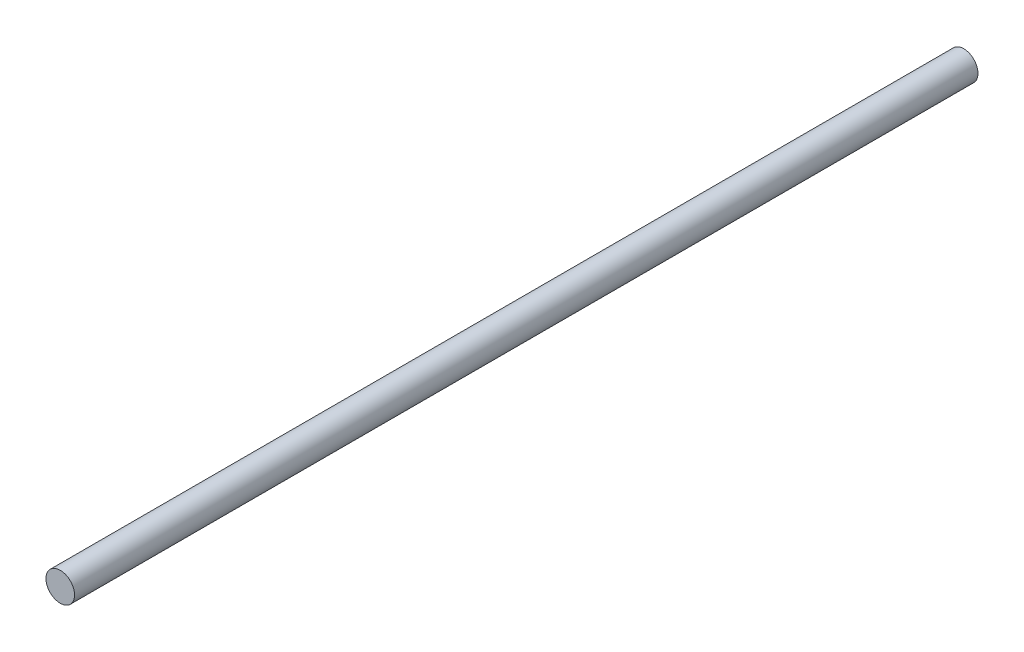
ISO-10303-21;
HEADER;
FILE_DESCRIPTION(('STEP AP214'),'2;1');
FILE_NAME('part.step','',(''),(''),'','','');
FILE_SCHEMA(('AUTOMOTIVE_DESIGN { 1 0 10303 214 1 1 1 1 }'));
ENDSEC;
DATA;
#1=APPLICATION_CONTEXT('core data for automotive mechanical design processes');
#2=APPLICATION_PROTOCOL_DEFINITION('international standard','automotive_design',2000,#1);
#3=PRODUCT_CONTEXT('',#1,'mechanical');
#4=PRODUCT('Part','Part','',(#3));
#5=PRODUCT_RELATED_PRODUCT_CATEGORY('part','',(#4));
#6=PRODUCT_DEFINITION_FORMATION('','',#4);
#7=PRODUCT_DEFINITION_CONTEXT('part definition',#1,'design');
#8=PRODUCT_DEFINITION('design','',#6,#7);
#9=PRODUCT_DEFINITION_SHAPE('','',#8);
#10=(LENGTH_UNIT() NAMED_UNIT(*) SI_UNIT(.MILLI.,.METRE.));
#11=(NAMED_UNIT(*) PLANE_ANGLE_UNIT() SI_UNIT($,.RADIAN.));
#12=(NAMED_UNIT(*) SI_UNIT($,.STERADIAN.) SOLID_ANGLE_UNIT());
#13=UNCERTAINTY_MEASURE_WITH_UNIT(LENGTH_MEASURE(1.E-05),#10,'distance_accuracy_value','');
#14=(GEOMETRIC_REPRESENTATION_CONTEXT(3) GLOBAL_UNCERTAINTY_ASSIGNED_CONTEXT((#13)) GLOBAL_UNIT_ASSIGNED_CONTEXT((#10,
#11,#12)) REPRESENTATION_CONTEXT('',''));
#15=CARTESIAN_POINT('',(0.,0.,0.));
#16=DIRECTION('',(0.,0.,1.));
#17=DIRECTION('',(1.,0.,0.));
#18=AXIS2_PLACEMENT_3D('',#15,#16,#17);
#19=CARTESIAN_POINT('',(-10.0165574589457,-10.0165574589457,250.739783017438));
#20=DIRECTION('',(0.,0.,-1.));
#21=DIRECTION('',(-1.,0.,0.));
#22=AXIS2_PLACEMENT_3D('',#19,#20,#21);
#23=CYLINDRICAL_SURFACE('',#22,3.79708670005155);
#24=CARTESIAN_POINT('',(-10.0165574589457,-10.0165574589457,0.));
#25=DIRECTION('',(0.,0.,1.));
#26=DIRECTION('',(1.,0.,0.));
#27=AXIS2_PLACEMENT_3D('',#24,#25,#26);
#28=CIRCLE('',#27,3.79708670005155);
#29=CARTESIAN_POINT('',(-6.21947075889412,-10.0165574589457,0.));
#30=VERTEX_POINT('',#29);
#31=EDGE_CURVE('E34',#30,#30,#28,.T.);
#32=ORIENTED_EDGE('',*,*,#31,.T.);
#33=EDGE_LOOP('',(#32));
#34=FACE_BOUND('',#33,.T.);
#35=CARTESIAN_POINT('',(-10.0165574589457,-10.0165574589457,239.999999999999));
#36=DIRECTION('',(0.,0.,1.));
#37=DIRECTION('',(1.,0.,0.));
#38=AXIS2_PLACEMENT_3D('',#35,#36,#37);
#39=CIRCLE('',#38,3.79708670005155);
#40=CARTESIAN_POINT('',(-6.21947075889412,-10.0165574589457,239.999999999999));
#41=VERTEX_POINT('',#40);
#42=EDGE_CURVE('E10',#41,#41,#39,.T.);
#43=ORIENTED_EDGE('',*,*,#42,.F.);
#44=EDGE_LOOP('',(#43));
#45=FACE_BOUND('',#44,.T.);
#46=ADVANCED_FACE('F31',(#34,#45),#23,.T.);
#47=CARTESIAN_POINT('',(-10.0165574589457,-10.0165574589457,0.));
#48=DIRECTION('',(0.,0.,1.));
#49=DIRECTION('',(1.,0.,0.));
#50=AXIS2_PLACEMENT_3D('',#47,#48,#49);
#51=PLANE('',#50);
#52=ORIENTED_EDGE('',*,*,#31,.F.);
#53=EDGE_LOOP('',(#52));
#54=FACE_BOUND('',#53,.T.);
#55=ADVANCED_FACE('F45',(#54),#51,.F.);
#56=CARTESIAN_POINT('',(-20.0331149178913,0.,239.999999999999));
#57=DIRECTION('',(0.,0.,1.));
#58=DIRECTION('',(1.,0.,0.));
#59=AXIS2_PLACEMENT_3D('',#56,#57,#58);
#60=PLANE('',#59);
#61=ORIENTED_EDGE('',*,*,#42,.T.);
#62=EDGE_LOOP('',(#61));
#63=FACE_BOUND('',#62,.T.);
#64=ADVANCED_FACE('F47',(#63),#60,.T.);
#65=CLOSED_SHELL('',(#46,#55,#64));
#66=MANIFOLD_SOLID_BREP('B2',#65);
#67=ADVANCED_BREP_SHAPE_REPRESENTATION('',(#18,#66),#14);
#68=SHAPE_DEFINITION_REPRESENTATION(#9,#67);
ENDSEC;
END-ISO-10303-21;
